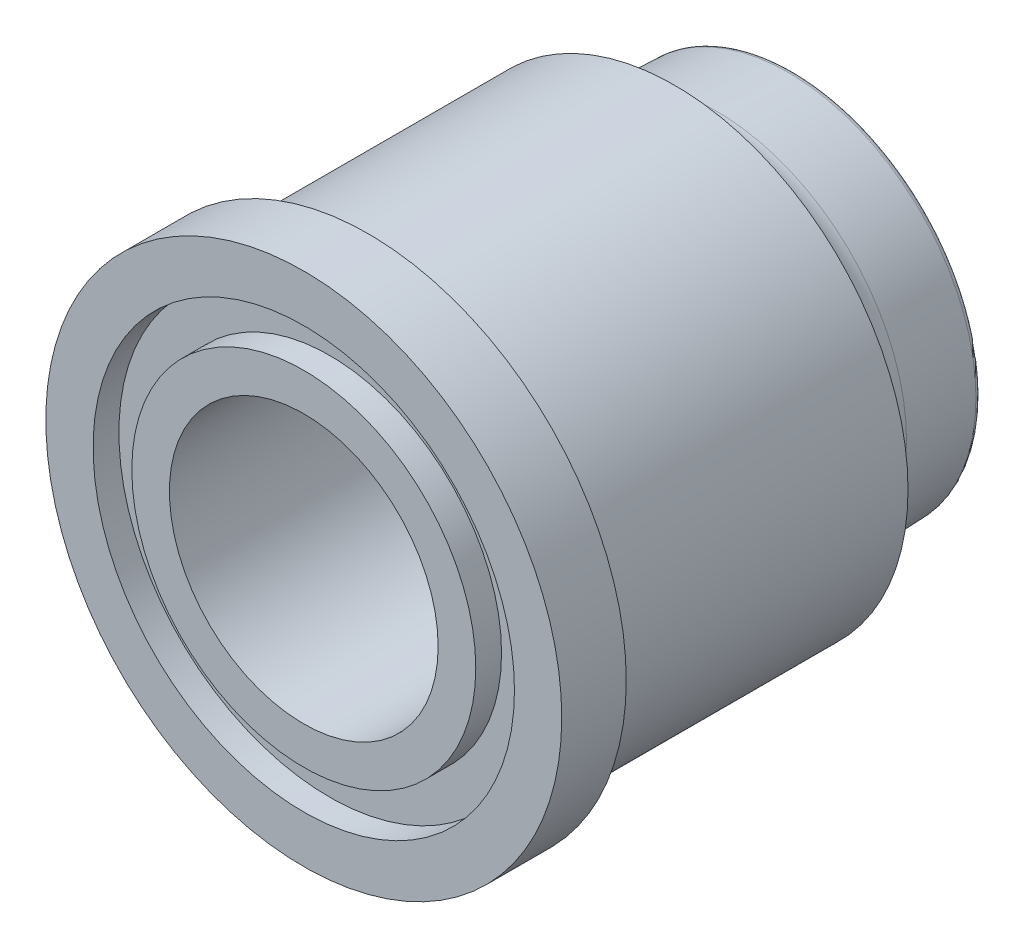
ISO-10303-21;
HEADER;
FILE_DESCRIPTION(('STEP AP214'),'2;1');
FILE_NAME('part.step','',(''),(''),'','','');
FILE_SCHEMA(('AUTOMOTIVE_DESIGN { 1 0 10303 214 1 1 1 1 }'));
ENDSEC;
DATA;
#1=APPLICATION_CONTEXT('core data for automotive mechanical design processes');
#2=APPLICATION_PROTOCOL_DEFINITION('international standard','automotive_design',2000,#1);
#3=PRODUCT_CONTEXT('',#1,'mechanical');
#4=PRODUCT('Part','Part','',(#3));
#5=PRODUCT_RELATED_PRODUCT_CATEGORY('part','',(#4));
#6=PRODUCT_DEFINITION_FORMATION('','',#4);
#7=PRODUCT_DEFINITION_CONTEXT('part definition',#1,'design');
#8=PRODUCT_DEFINITION('design','',#6,#7);
#9=PRODUCT_DEFINITION_SHAPE('','',#8);
#10=(LENGTH_UNIT() NAMED_UNIT(*) SI_UNIT(.MILLI.,.METRE.));
#11=(NAMED_UNIT(*) PLANE_ANGLE_UNIT() SI_UNIT($,.RADIAN.));
#12=(NAMED_UNIT(*) SI_UNIT($,.STERADIAN.) SOLID_ANGLE_UNIT());
#13=UNCERTAINTY_MEASURE_WITH_UNIT(LENGTH_MEASURE(1.E-05),#10,'distance_accuracy_value','');
#14=(GEOMETRIC_REPRESENTATION_CONTEXT(3) GLOBAL_UNCERTAINTY_ASSIGNED_CONTEXT((#13)) GLOBAL_UNIT_ASSIGNED_CONTEXT((#10,
#11,#12)) REPRESENTATION_CONTEXT('',''));
#15=CARTESIAN_POINT('',(0.,0.,0.));
#16=DIRECTION('',(0.,0.,1.));
#17=DIRECTION('',(1.,0.,0.));
#18=AXIS2_PLACEMENT_3D('',#15,#16,#17);
#19=CARTESIAN_POINT('',(0.,0.,-106.983426835244));
#20=DIRECTION('',(0.,0.,1.));
#21=DIRECTION('',(1.,0.,0.));
#22=AXIS2_PLACEMENT_3D('',#19,#20,#21);
#23=CYLINDRICAL_SURFACE('',#22,21.7208802369448);
#24=CARTESIAN_POINT('',(8.05070259751901E-12,-4.06534861420354E-12,-34.4924999997064));
#25=DIRECTION('',(-5.33833708127146E-12,2.69575334284611E-12,-1.));
#26=DIRECTION('',(1.,0.,-5.33845105554078E-12));
#27=AXIS2_PLACEMENT_3D('',#24,#25,#26);
#28=CIRCLE('',#27,21.720880236945);
#29=CARTESIAN_POINT('',(21.7208802369527,-4.27458415947017E-12,-34.4924999998223));
#30=VERTEX_POINT('',#29);
#31=CARTESIAN_POINT('',(-21.7208802369448,-4.49773898742142E-12,-34.4924999995904));
#32=VERTEX_POINT('',#31);
#33=EDGE_CURVE('E68',#30,#32,#28,.T.);
#34=ORIENTED_EDGE('',*,*,#33,.F.);
#35=CARTESIAN_POINT('',(8.05070259751904E-12,-4.06534861420355E-12,-34.4924999997064));
#36=DIRECTION('',(-5.33833708127146E-12,2.69575334284611E-12,-1.));
#37=DIRECTION('',(-1.,0.,5.33845105554084E-12));
#38=AXIS2_PLACEMENT_3D('',#35,#36,#37);
#39=CIRCLE('',#38,21.7208802369447);
#40=EDGE_CURVE('E65',#32,#30,#39,.T.);
#41=ORIENTED_EDGE('',*,*,#40,.F.);
#42=EDGE_LOOP('',(#34,#41));
#43=FACE_BOUND('',#42,.T.);
#44=CARTESIAN_POINT('',(0.,0.,-6.00000000000001));
#45=DIRECTION('',(0.,0.,1.));
#46=DIRECTION('',(1.,0.,0.));
#47=AXIS2_PLACEMENT_3D('',#44,#45,#46);
#48=CIRCLE('',#47,21.7208802369448);
#49=CARTESIAN_POINT('',(21.7208802369448,0.,-6.00000000000001));
#50=VERTEX_POINT('',#49);
#51=EDGE_CURVE('E74',#50,#50,#48,.F.);
#52=ORIENTED_EDGE('',*,*,#51,.T.);
#53=EDGE_LOOP('',(#52));
#54=FACE_BOUND('',#53,.T.);
#55=ADVANCED_FACE('F34',(#43,#54),#23,.T.);
#56=CARTESIAN_POINT('',(-1.34094124691923E-11,6.77157982403783E-12,-38.5124999997064));
#57=DIRECTION('',(5.33833708127146E-12,-2.69575334284611E-12,1.));
#58=DIRECTION('',(1.,0.,-5.33833708127146E-12));
#59=AXIS2_PLACEMENT_3D('',#56,#57,#58);
#60=TOROIDAL_SURFACE('',#59,21.7208802369449,4.02);
#61=ORIENTED_EDGE('',*,*,#33,.T.);
#62=ORIENTED_EDGE('',*,*,#40,.T.);
#63=EDGE_LOOP('',(#61,#62));
#64=FACE_BOUND('',#63,.T.);
#65=CARTESIAN_POINT('',(-1.26562649248682E-11,6.43684758211334E-12,-38.3722040229623));
#66=DIRECTION('',(5.33833708127146E-12,-2.69575334284611E-12,1.));
#67=DIRECTION('',(1.,0.,-5.33834652715916E-12));
#68=AXIS2_PLACEMENT_3D('',#65,#66,#67);
#69=CIRCLE('',#68,17.7033291123282);
#70=CARTESIAN_POINT('',(17.7033291123155,6.43684758211334E-12,-38.3722040230568));
#71=VERTEX_POINT('',#70);
#72=EDGE_CURVE('E79',#71,#71,#69,.F.);
#73=ORIENTED_EDGE('',*,*,#72,.F.);
#74=EDGE_LOOP('',(#73));
#75=FACE_BOUND('',#74,.T.);
#76=ADVANCED_FACE('F70',(#64,#75),#60,.F.);
#77=CARTESIAN_POINT('',(-1.24749516271591E-11,5.99053792621402E-12,-38.3722040229622));
#78=DIRECTION('',(5.33802647289008E-12,-2.69565166548275E-12,1.));
#79=DIRECTION('',(-1.,0.,5.33802647293325E-12));
#80=AXIS2_PLACEMENT_3D('',#77,#78,#79);
#81=CONICAL_SURFACE('',#80,17.7033291123282,0.0349065850398852);
#82=ORIENTED_EDGE('',*,*,#72,.T.);
#83=EDGE_LOOP('',(#82));
#84=FACE_BOUND('',#83,.T.);
#85=CARTESIAN_POINT('',(-4.81936712755622E-11,2.4177656404111E-11,-45.0625369967993));
#86=DIRECTION('',(5.33832814557038E-12,-2.69565162908483E-12,1.));
#87=DIRECTION('',(1.,3.19741568888935E-10,-5.34105483167615E-12));
#88=AXIS2_PLACEMENT_3D('',#85,#86,#87);
#89=CIRCLE('',#88,17.4696975367258);
#90=CARTESIAN_POINT('',(17.4696975366776,5.60996615481196E-09,-45.0625369968926));
#91=VERTEX_POINT('',#90);
#92=EDGE_CURVE('E147',#91,#91,#89,.T.);
#93=ORIENTED_EDGE('',*,*,#92,.T.);
#94=EDGE_LOOP('',(#93));
#95=FACE_BOUND('',#94,.T.);
#96=ADVANCED_FACE('F138',(#84,#95),#81,.T.);
#97=CARTESIAN_POINT('',(-4.85841922244748E-11,2.39545015761614E-11,-45.0449999997063));
#98=DIRECTION('',(5.33833708127146E-12,-2.69575334284611E-12,1.));
#99=DIRECTION('',(1.,0.,-5.33833708127146E-12));
#100=AXIS2_PLACEMENT_3D('',#97,#98,#99);
#101=TOROIDAL_SURFACE('',#100,16.9675036461487,0.5025);
#102=CARTESIAN_POINT('',(-5.12667066078138E-11,2.53091176309415E-11,-45.5474999997063));
#103=DIRECTION('',(5.33833708127146E-12,-2.69575334284611E-12,1.));
#104=DIRECTION('',(1.,0.,-5.33845891008025E-12));
#105=AXIS2_PLACEMENT_3D('',#102,#103,#104);
#106=CIRCLE('',#105,16.9675036461493);
#107=CARTESIAN_POINT('',(16.9675036460979,2.55165853718089E-11,-45.5474999997969));
#108=VERTEX_POINT('',#107);
#109=CARTESIAN_POINT('',(16.1097665307685,5.32650000514834,-45.547499999778));
#110=VERTEX_POINT('',#109);
#111=EDGE_CURVE('E57',#108,#110,#106,.T.);
#112=ORIENTED_EDGE('',*,*,#111,.T.);
#113=CARTESIAN_POINT('',(-5.12667066078138E-11,2.53091176309415E-11,-45.5474999997063));
#114=DIRECTION('',(5.33833708127146E-12,-2.69575334284611E-12,1.));
#115=DIRECTION('',(0.949448243346959,0.313923610461802,-4.2220200542108E-12));
#116=AXIS2_PLACEMENT_3D('',#113,#114,#115);
#117=CIRCLE('',#116,16.9675036461496);
#118=CARTESIAN_POINT('',(-16.9675036462,2.58513176137335E-11,-45.5474999996158));
#119=VERTEX_POINT('',#118);
#120=EDGE_CURVE('E116',#110,#119,#117,.T.);
#121=ORIENTED_EDGE('',*,*,#120,.T.);
#122=CARTESIAN_POINT('',(-5.12667066078137E-11,2.53091176309415E-11,-45.5474999997063));
#123=DIRECTION('',(5.33833708127146E-12,-2.69575334284611E-12,1.));
#124=DIRECTION('',(-1.,0.,5.33845891008036E-12));
#125=AXIS2_PLACEMENT_3D('',#122,#123,#124);
#126=CIRCLE('',#125,16.967503646149);
#127=EDGE_CURVE('E51',#119,#108,#126,.T.);
#128=ORIENTED_EDGE('',*,*,#127,.T.);
#129=EDGE_LOOP('',(#112,#121,#128));
#130=FACE_BOUND('',#129,.T.);
#131=ORIENTED_EDGE('',*,*,#92,.F.);
#132=EDGE_LOOP('',(#131));
#133=FACE_BOUND('',#132,.T.);
#134=ADVANCED_FACE('F99',(#130,#133),#101,.T.);
#135=CARTESIAN_POINT('',(15.3642305837056,-8.21580494054474,-45.5474999998106));
#136=DIRECTION('',(5.33833708127146E-12,-2.6957533411392E-12,1.));
#137=DIRECTION('',(-1.,0.,5.33833708131463E-12));
#138=AXIS2_PLACEMENT_3D('',#135,#136,#137);
#139=PLANE('',#138);
#140=ORIENTED_EDGE('',*,*,#111,.F.);
#141=ORIENTED_EDGE('',*,*,#127,.F.);
#142=ORIENTED_EDGE('',*,*,#120,.F.);
#143=EDGE_LOOP('',(#140,#141,#142));
#144=FACE_BOUND('',#143,.T.);
#145=ADVANCED_FACE('F89',(#144),#139,.F.);
#146=CARTESIAN_POINT('',(0.,0.,-6.));
#147=DIRECTION('',(0.,0.,1.));
#148=DIRECTION('',(1.,0.,0.));
#149=AXIS2_PLACEMENT_3D('',#146,#147,#148);
#150=CYLINDRICAL_SURFACE('',#149,24.);
#151=CARTESIAN_POINT('',(0.,0.,-6.));
#152=DIRECTION('',(0.,0.,1.));
#153=DIRECTION('',(1.,0.,0.));
#154=AXIS2_PLACEMENT_3D('',#151,#152,#153);
#155=CIRCLE('',#154,24.);
#156=CARTESIAN_POINT('',(24.,0.,-6.));
#157=VERTEX_POINT('',#156);
#158=EDGE_CURVE('E161',#157,#157,#155,.T.);
#159=ORIENTED_EDGE('',*,*,#158,.T.);
#160=EDGE_LOOP('',(#159));
#161=FACE_BOUND('',#160,.T.);
#162=CARTESIAN_POINT('',(0.,0.,0.));
#163=DIRECTION('',(0.,0.,1.));
#164=DIRECTION('',(1.,0.,0.));
#165=AXIS2_PLACEMENT_3D('',#162,#163,#164);
#166=CIRCLE('',#165,24.);
#167=CARTESIAN_POINT('',(24.,0.,0.));
#168=VERTEX_POINT('',#167);
#169=EDGE_CURVE('E307',#168,#168,#166,.T.);
#170=ORIENTED_EDGE('',*,*,#169,.F.);
#171=EDGE_LOOP('',(#170));
#172=FACE_BOUND('',#171,.T.);
#173=ADVANCED_FACE('F98',(#161,#172),#150,.T.);
#174=CARTESIAN_POINT('',(0.,0.,-6.));
#175=DIRECTION('',(0.,0.,1.));
#176=DIRECTION('',(1.,0.,0.));
#177=AXIS2_PLACEMENT_3D('',#174,#175,#176);
#178=PLANE('',#177);
#179=ORIENTED_EDGE('',*,*,#51,.F.);
#180=EDGE_LOOP('',(#179));
#181=FACE_BOUND('',#180,.T.);
#182=ORIENTED_EDGE('',*,*,#158,.F.);
#183=EDGE_LOOP('',(#182));
#184=FACE_BOUND('',#183,.T.);
#185=ADVANCED_FACE('F206',(#181,#184),#178,.F.);
#186=CARTESIAN_POINT('',(0.,0.,0.));
#187=DIRECTION('',(0.,0.,1.));
#188=DIRECTION('',(1.,0.,0.));
#189=AXIS2_PLACEMENT_3D('',#186,#187,#188);
#190=PLANE('',#189);
#191=CARTESIAN_POINT('',(0.,0.,0.));
#192=DIRECTION('',(0.,0.,1.));
#193=DIRECTION('',(1.,0.,0.));
#194=AXIS2_PLACEMENT_3D('',#191,#192,#193);
#195=CIRCLE('',#194,19.6);
#196=CARTESIAN_POINT('',(19.6,0.,0.));
#197=VERTEX_POINT('',#196);
#198=EDGE_CURVE('E313',#197,#197,#195,.T.);
#199=ORIENTED_EDGE('',*,*,#198,.F.);
#200=EDGE_LOOP('',(#199));
#201=FACE_BOUND('',#200,.T.);
#202=ORIENTED_EDGE('',*,*,#169,.T.);
#203=EDGE_LOOP('',(#202));
#204=FACE_BOUND('',#203,.T.);
#205=ADVANCED_FACE('F139',(#201,#204),#190,.T.);
#206=CARTESIAN_POINT('',(0.,0.,-2.4));
#207=DIRECTION('',(0.,0.,1.));
#208=DIRECTION('',(1.,0.,0.));
#209=AXIS2_PLACEMENT_3D('',#206,#207,#208);
#210=CYLINDRICAL_SURFACE('',#209,19.6);
#211=CARTESIAN_POINT('',(0.,0.,-2.4));
#212=DIRECTION('',(0.,0.,1.));
#213=DIRECTION('',(1.,0.,0.));
#214=AXIS2_PLACEMENT_3D('',#211,#212,#213);
#215=CIRCLE('',#214,19.6);
#216=CARTESIAN_POINT('',(19.6,0.,-2.4));
#217=VERTEX_POINT('',#216);
#218=EDGE_CURVE('E308',#217,#217,#215,.T.);
#219=ORIENTED_EDGE('',*,*,#218,.F.);
#220=EDGE_LOOP('',(#219));
#221=FACE_BOUND('',#220,.T.);
#222=ORIENTED_EDGE('',*,*,#198,.T.);
#223=EDGE_LOOP('',(#222));
#224=FACE_BOUND('',#223,.T.);
#225=ADVANCED_FACE('F220',(#221,#224),#210,.F.);
#226=CARTESIAN_POINT('',(0.,0.,-2.4));
#227=DIRECTION('',(0.,0.,1.));
#228=DIRECTION('',(1.,0.,0.));
#229=AXIS2_PLACEMENT_3D('',#226,#227,#228);
#230=PLANE('',#229);
#231=CARTESIAN_POINT('',(0.,0.,-2.4));
#232=DIRECTION('',(0.,0.,1.));
#233=DIRECTION('',(1.,0.,0.));
#234=AXIS2_PLACEMENT_3D('',#231,#232,#233);
#235=CIRCLE('',#234,16.);
#236=CARTESIAN_POINT('',(16.,0.,-2.4));
#237=VERTEX_POINT('',#236);
#238=EDGE_CURVE('E332',#237,#237,#235,.T.);
#239=ORIENTED_EDGE('',*,*,#238,.F.);
#240=EDGE_LOOP('',(#239));
#241=FACE_BOUND('',#240,.T.);
#242=ORIENTED_EDGE('',*,*,#218,.T.);
#243=EDGE_LOOP('',(#242));
#244=FACE_BOUND('',#243,.T.);
#245=ADVANCED_FACE('F228',(#241,#244),#230,.T.);
#246=CARTESIAN_POINT('',(0.,0.,-2.4));
#247=DIRECTION('',(0.,0.,1.));
#248=DIRECTION('',(1.,0.,0.));
#249=AXIS2_PLACEMENT_3D('',#246,#247,#248);
#250=CYLINDRICAL_SURFACE('',#249,16.);
#251=ORIENTED_EDGE('',*,*,#238,.T.);
#252=EDGE_LOOP('',(#251));
#253=FACE_BOUND('',#252,.T.);
#254=CARTESIAN_POINT('',(0.,0.,0.));
#255=DIRECTION('',(0.,0.,1.));
#256=DIRECTION('',(1.,0.,0.));
#257=AXIS2_PLACEMENT_3D('',#254,#255,#256);
#258=CIRCLE('',#257,16.);
#259=CARTESIAN_POINT('',(16.,0.,0.));
#260=VERTEX_POINT('',#259);
#261=EDGE_CURVE('E334',#260,#260,#258,.T.);
#262=ORIENTED_EDGE('',*,*,#261,.F.);
#263=EDGE_LOOP('',(#262));
#264=FACE_BOUND('',#263,.T.);
#265=ADVANCED_FACE('F236',(#253,#264),#250,.T.);
#266=CARTESIAN_POINT('',(0.,0.,-38.));
#267=DIRECTION('',(0.,0.,1.));
#268=DIRECTION('',(1.,0.,0.));
#269=AXIS2_PLACEMENT_3D('',#266,#267,#268);
#270=PLANE('',#269);
#271=CARTESIAN_POINT('',(0.,0.,-38.));
#272=DIRECTION('',(0.,0.,1.));
#273=DIRECTION('',(1.,0.,0.));
#274=AXIS2_PLACEMENT_3D('',#271,#272,#273);
#275=CIRCLE('',#274,10.5);
#276=CARTESIAN_POINT('',(10.5,0.,-38.));
#277=VERTEX_POINT('',#276);
#278=EDGE_CURVE('E43',#277,#277,#275,.T.);
#279=ORIENTED_EDGE('',*,*,#278,.T.);
#280=EDGE_LOOP('',(#279));
#281=FACE_BOUND('',#280,.T.);
#282=ADVANCED_FACE('F244',(#281),#270,.T.);
#283=CARTESIAN_POINT('',(0.,0.,-38.));
#284=DIRECTION('',(0.,0.,1.));
#285=DIRECTION('',(1.,0.,0.));
#286=AXIS2_PLACEMENT_3D('',#283,#284,#285);
#287=CYLINDRICAL_SURFACE('',#286,12.5);
#288=CARTESIAN_POINT('',(0.,0.,-36.));
#289=DIRECTION('',(0.,0.,1.));
#290=DIRECTION('',(1.,0.,0.));
#291=AXIS2_PLACEMENT_3D('',#288,#289,#290);
#292=CIRCLE('',#291,12.5);
#293=CARTESIAN_POINT('',(12.5,0.,-36.));
#294=VERTEX_POINT('',#293);
#295=EDGE_CURVE('E11',#294,#294,#292,.F.);
#296=ORIENTED_EDGE('',*,*,#295,.T.);
#297=EDGE_LOOP('',(#296));
#298=FACE_BOUND('',#297,.T.);
#299=CARTESIAN_POINT('',(0.,0.,0.));
#300=DIRECTION('',(0.,0.,1.));
#301=DIRECTION('',(1.,0.,0.));
#302=AXIS2_PLACEMENT_3D('',#299,#300,#301);
#303=CIRCLE('',#302,12.5);
#304=CARTESIAN_POINT('',(12.5,0.,0.));
#305=VERTEX_POINT('',#304);
#306=EDGE_CURVE('E306',#305,#305,#303,.T.);
#307=ORIENTED_EDGE('',*,*,#306,.T.);
#308=EDGE_LOOP('',(#307));
#309=FACE_BOUND('',#308,.T.);
#310=ADVANCED_FACE('F253',(#298,#309),#287,.F.);
#311=ORIENTED_EDGE('',*,*,#306,.F.);
#312=EDGE_LOOP('',(#311));
#313=FACE_BOUND('',#312,.T.);
#314=ORIENTED_EDGE('',*,*,#261,.T.);
#315=EDGE_LOOP('',(#314));
#316=FACE_BOUND('',#315,.T.);
#317=ADVANCED_FACE('F222',(#313,#316),#190,.T.);
#318=CARTESIAN_POINT('',(0.,0.,-36.));
#319=DIRECTION('',(0.,0.,1.));
#320=DIRECTION('',(1.,0.,0.));
#321=AXIS2_PLACEMENT_3D('',#318,#319,#320);
#322=TOROIDAL_SURFACE('',#321,10.5,2.);
#323=ORIENTED_EDGE('',*,*,#295,.F.);
#324=EDGE_LOOP('',(#323));
#325=FACE_BOUND('',#324,.T.);
#326=ORIENTED_EDGE('',*,*,#278,.F.);
#327=EDGE_LOOP('',(#326));
#328=FACE_BOUND('',#327,.T.);
#329=ADVANCED_FACE('F36',(#325,#328),#322,.F.);
#330=CLOSED_SHELL('',(#55,#76,#96,#134,#145,#173,#185,#205,#225,#245,#265,#282,#310,#317,#329));
#331=MANIFOLD_SOLID_BREP('B2',#330);
#332=ADVANCED_BREP_SHAPE_REPRESENTATION('',(#18,#331),#14);
#333=SHAPE_DEFINITION_REPRESENTATION(#9,#332);
ENDSEC;
END-ISO-10303-21;
